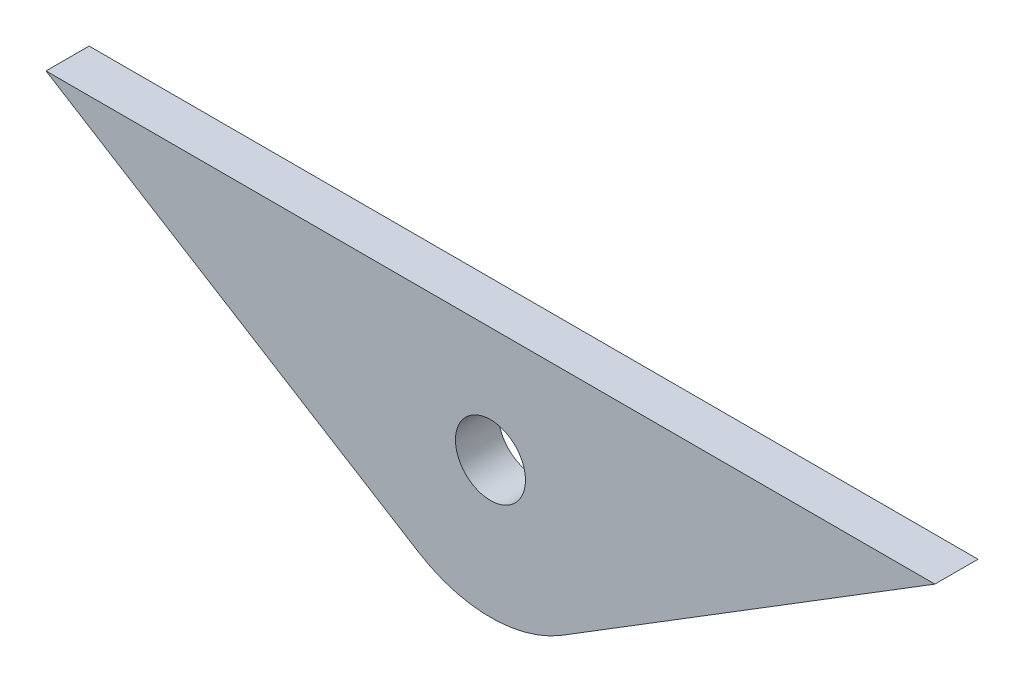
ISO-10303-21;
HEADER;
FILE_DESCRIPTION(('STEP AP214'),'2;1');
FILE_NAME('part.step','',(''),(''),'','','');
FILE_SCHEMA(('AUTOMOTIVE_DESIGN { 1 0 10303 214 1 1 1 1 }'));
ENDSEC;
DATA;
#1=APPLICATION_CONTEXT('core data for automotive mechanical design processes');
#2=APPLICATION_PROTOCOL_DEFINITION('international standard','automotive_design',2000,#1);
#3=PRODUCT_CONTEXT('',#1,'mechanical');
#4=PRODUCT('Part','Part','',(#3));
#5=PRODUCT_RELATED_PRODUCT_CATEGORY('part','',(#4));
#6=PRODUCT_DEFINITION_FORMATION('','',#4);
#7=PRODUCT_DEFINITION_CONTEXT('part definition',#1,'design');
#8=PRODUCT_DEFINITION('design','',#6,#7);
#9=PRODUCT_DEFINITION_SHAPE('','',#8);
#10=(LENGTH_UNIT() NAMED_UNIT(*) SI_UNIT(.MILLI.,.METRE.));
#11=(NAMED_UNIT(*) PLANE_ANGLE_UNIT() SI_UNIT($,.RADIAN.));
#12=(NAMED_UNIT(*) SI_UNIT($,.STERADIAN.) SOLID_ANGLE_UNIT());
#13=UNCERTAINTY_MEASURE_WITH_UNIT(LENGTH_MEASURE(1.E-05),#10,'distance_accuracy_value','');
#14=(GEOMETRIC_REPRESENTATION_CONTEXT(3) GLOBAL_UNCERTAINTY_ASSIGNED_CONTEXT((#13)) GLOBAL_UNIT_ASSIGNED_CONTEXT((#10,
#11,#12)) REPRESENTATION_CONTEXT('',''));
#15=CARTESIAN_POINT('',(0.,0.,0.));
#16=DIRECTION('',(0.,0.,1.));
#17=DIRECTION('',(1.,0.,0.));
#18=AXIS2_PLACEMENT_3D('',#15,#16,#17);
#19=CARTESIAN_POINT('',(-82.5016670475534,0.,-4.));
#20=DIRECTION('',(0.,0.999999999999999,0.));
#21=DIRECTION('',(0.,0.,0.999999999999999));
#22=AXIS2_PLACEMENT_3D('',#19,#20,#21);
#23=PLANE('',#22);
#24=DIRECTION('',(-0.999999999999999,0.,0.));
#25=VECTOR('',#24,1.);
#26=CARTESIAN_POINT('',(-82.5016670475534,0.,0.));
#27=LINE('',#26,#25);
#28=CARTESIAN_POINT('',(0.,0.,0.));
#29=VERTEX_POINT('',#28);
#30=CARTESIAN_POINT('',(-82.5016670475534,0.,0.));
#31=VERTEX_POINT('',#30);
#32=EDGE_CURVE('E99',#29,#31,#27,.T.);
#33=ORIENTED_EDGE('',*,*,#32,.F.);
#34=DIRECTION('',(0.,0.,0.999999999999999));
#35=VECTOR('',#34,1.);
#36=CARTESIAN_POINT('',(0.,0.,-4.));
#37=LINE('',#36,#35);
#38=CARTESIAN_POINT('',(0.,0.,-4.));
#39=VERTEX_POINT('',#38);
#40=EDGE_CURVE('E11',#39,#29,#37,.T.);
#41=ORIENTED_EDGE('',*,*,#40,.F.);
#42=DIRECTION('',(-0.999999999999999,0.,0.));
#43=VECTOR('',#42,1.);
#44=CARTESIAN_POINT('',(-82.5016670475534,0.,-4.));
#45=LINE('',#44,#43);
#46=CARTESIAN_POINT('',(-82.5016670475534,0.,-4.));
#47=VERTEX_POINT('',#46);
#48=EDGE_CURVE('E92',#39,#47,#45,.T.);
#49=ORIENTED_EDGE('',*,*,#48,.T.);
#50=DIRECTION('',(0.,0.,0.999999999999999));
#51=VECTOR('',#50,1.);
#52=CARTESIAN_POINT('',(-82.5016670475534,0.,-4.));
#53=LINE('',#52,#51);
#54=EDGE_CURVE('E37',#47,#31,#53,.T.);
#55=ORIENTED_EDGE('',*,*,#54,.T.);
#56=EDGE_LOOP('',(#33,#41,#49,#55));
#57=FACE_BOUND('',#56,.T.);
#58=ADVANCED_FACE('F34',(#57),#23,.T.);
#59=CARTESIAN_POINT('',(-34.5943627091045,-21.4070393832791,-4.00000000000017));
#60=DIRECTION('',(0.5262032264563,-0.850358844527989,0.));
#61=DIRECTION('',(0.85035884452799,0.526203226456302,0.));
#62=AXIS2_PLACEMENT_3D('',#59,#60,#61);
#63=PLANE('',#62);
#64=DIRECTION('',(0.85035884452799,0.526203226456302,0.));
#65=VECTOR('',#64,1.);
#66=CARTESIAN_POINT('',(-34.5943627091045,-21.4070393832791,-1.66533453693773E-13));
#67=LINE('',#66,#65);
#68=CARTESIAN_POINT('',(-34.5943627091045,-21.4070393832791,-1.66533453693773E-13));
#69=VERTEX_POINT('',#68);
#70=EDGE_CURVE('E94',#69,#29,#67,.T.);
#71=ORIENTED_EDGE('',*,*,#70,.F.);
#72=DIRECTION('',(0.,0.,0.999999999999999));
#73=VECTOR('',#72,1.);
#74=CARTESIAN_POINT('',(-34.5943627091045,-21.4070393832791,-4.00000000000017));
#75=LINE('',#74,#73);
#76=CARTESIAN_POINT('',(-34.5943627091045,-21.4070393832791,-4.00000000000017));
#77=VERTEX_POINT('',#76);
#78=EDGE_CURVE('E43',#77,#69,#75,.T.);
#79=ORIENTED_EDGE('',*,*,#78,.F.);
#80=DIRECTION('',(0.85035884452799,0.526203226456302,0.));
#81=VECTOR('',#80,1.);
#82=CARTESIAN_POINT('',(-34.5943627091045,-21.4070393832791,-4.00000000000017));
#83=LINE('',#82,#81);
#84=EDGE_CURVE('E89',#77,#39,#83,.T.);
#85=ORIENTED_EDGE('',*,*,#84,.T.);
#86=ORIENTED_EDGE('',*,*,#40,.T.);
#87=EDGE_LOOP('',(#71,#79,#85,#86));
#88=FACE_BOUND('',#87,.T.);
#89=ADVANCED_FACE('F110',(#88),#63,.T.);
#90=CARTESIAN_POINT('',(-41.2508335237767,-10.6500000000001,-4.00000000000017));
#91=DIRECTION('',(0.,0.,0.999999999999999));
#92=DIRECTION('',(0.999999999999999,0.,0.));
#93=AXIS2_PLACEMENT_3D('',#90,#91,#92);
#94=CYLINDRICAL_SURFACE('',#93,12.65);
#95=CARTESIAN_POINT('',(-41.2508335237767,-10.65,-1.66533453693773E-13));
#96=DIRECTION('',(0.,0.,0.999999999999999));
#97=DIRECTION('',(0.999999999999999,0.,0.));
#98=AXIS2_PLACEMENT_3D('',#95,#96,#97);
#99=CIRCLE('',#98,12.65);
#100=CARTESIAN_POINT('',(-47.9073043384489,-21.4070393832791,0.));
#101=VERTEX_POINT('',#100);
#102=EDGE_CURVE('E84',#101,#69,#99,.T.);
#103=ORIENTED_EDGE('',*,*,#102,.F.);
#104=DIRECTION('',(0.,0.,0.999999999999999));
#105=VECTOR('',#104,1.);
#106=CARTESIAN_POINT('',(-47.9073043384489,-21.4070393832791,-4.));
#107=LINE('',#106,#105);
#108=CARTESIAN_POINT('',(-47.9073043384489,-21.4070393832791,-4.));
#109=VERTEX_POINT('',#108);
#110=EDGE_CURVE('E79',#109,#101,#107,.T.);
#111=ORIENTED_EDGE('',*,*,#110,.F.);
#112=CARTESIAN_POINT('',(-41.2508335237767,-10.6500000000001,-4.00000000000017));
#113=DIRECTION('',(0.,0.,0.999999999999999));
#114=DIRECTION('',(0.999999999999999,0.,0.));
#115=AXIS2_PLACEMENT_3D('',#112,#113,#114);
#116=CIRCLE('',#115,12.65);
#117=EDGE_CURVE('E82',#109,#77,#116,.T.);
#118=ORIENTED_EDGE('',*,*,#117,.T.);
#119=ORIENTED_EDGE('',*,*,#78,.T.);
#120=EDGE_LOOP('',(#103,#111,#118,#119));
#121=FACE_BOUND('',#120,.T.);
#122=ADVANCED_FACE('F81',(#121),#94,.T.);
#123=CARTESIAN_POINT('',(-82.5016670475534,0.,-4.));
#124=DIRECTION('',(-0.526203226456302,-0.85035884452799,0.));
#125=DIRECTION('',(0.850358844527989,-0.5262032264563,0.));
#126=AXIS2_PLACEMENT_3D('',#123,#124,#125);
#127=PLANE('',#126);
#128=DIRECTION('',(0.850358844527989,-0.5262032264563,0.));
#129=VECTOR('',#128,1.);
#130=CARTESIAN_POINT('',(-82.5016670475534,0.,0.));
#131=LINE('',#130,#129);
#132=EDGE_CURVE('E102',#31,#101,#131,.T.);
#133=ORIENTED_EDGE('',*,*,#132,.F.);
#134=ORIENTED_EDGE('',*,*,#54,.F.);
#135=DIRECTION('',(0.850358844527989,-0.5262032264563,0.));
#136=VECTOR('',#135,1.);
#137=CARTESIAN_POINT('',(-82.5016670475534,0.,-4.));
#138=LINE('',#137,#136);
#139=EDGE_CURVE('E88',#47,#109,#138,.T.);
#140=ORIENTED_EDGE('',*,*,#139,.T.);
#141=ORIENTED_EDGE('',*,*,#110,.T.);
#142=EDGE_LOOP('',(#133,#134,#140,#141));
#143=FACE_BOUND('',#142,.T.);
#144=ADVANCED_FACE('F91',(#143),#127,.T.);
#145=CARTESIAN_POINT('',(-41.2508335237767,-10.6500000000001,-4.00000000000017));
#146=DIRECTION('',(0.,0.,0.999999999999999));
#147=DIRECTION('',(0.999999999999999,0.,0.));
#148=AXIS2_PLACEMENT_3D('',#145,#146,#147);
#149=PLANE('',#148);
#150=CARTESIAN_POINT('',(-41.2508335237767,-10.6500000000001,-4.00000000000017));
#151=DIRECTION('',(0.,0.,0.999999999999999));
#152=DIRECTION('',(0.999999999999999,0.,0.));
#153=AXIS2_PLACEMENT_3D('',#150,#151,#152);
#154=CIRCLE('',#153,3.25);
#155=CARTESIAN_POINT('',(-38.0008335237767,-10.6500000000001,-4.00000000000017));
#156=VERTEX_POINT('',#155);
#157=EDGE_CURVE('E103',#156,#156,#154,.T.);
#158=ORIENTED_EDGE('',*,*,#157,.T.);
#159=EDGE_LOOP('',(#158));
#160=FACE_BOUND('',#159,.T.);
#161=ORIENTED_EDGE('',*,*,#48,.F.);
#162=ORIENTED_EDGE('',*,*,#84,.F.);
#163=ORIENTED_EDGE('',*,*,#117,.F.);
#164=ORIENTED_EDGE('',*,*,#139,.F.);
#165=EDGE_LOOP('',(#161,#162,#163,#164));
#166=FACE_BOUND('',#165,.T.);
#167=ADVANCED_FACE('F87',(#160,#166),#149,.F.);
#168=CARTESIAN_POINT('',(-41.2508335237767,-10.65,-1.66533453693773E-13));
#169=DIRECTION('',(0.,0.,0.999999999999999));
#170=DIRECTION('',(0.999999999999999,0.,0.));
#171=AXIS2_PLACEMENT_3D('',#168,#169,#170);
#172=PLANE('',#171);
#173=CARTESIAN_POINT('',(-41.2508335237767,-10.65,-1.66533453693773E-13));
#174=DIRECTION('',(0.,0.,0.999999999999999));
#175=DIRECTION('',(0.999999999999999,0.,0.));
#176=AXIS2_PLACEMENT_3D('',#173,#174,#175);
#177=CIRCLE('',#176,3.25);
#178=CARTESIAN_POINT('',(-38.0008335237767,-10.65,-1.66533453693773E-13));
#179=VERTEX_POINT('',#178);
#180=EDGE_CURVE('E140',#179,#179,#177,.T.);
#181=ORIENTED_EDGE('',*,*,#180,.F.);
#182=EDGE_LOOP('',(#181));
#183=FACE_BOUND('',#182,.T.);
#184=ORIENTED_EDGE('',*,*,#32,.T.);
#185=ORIENTED_EDGE('',*,*,#132,.T.);
#186=ORIENTED_EDGE('',*,*,#102,.T.);
#187=ORIENTED_EDGE('',*,*,#70,.T.);
#188=EDGE_LOOP('',(#184,#185,#186,#187));
#189=FACE_BOUND('',#188,.T.);
#190=ADVANCED_FACE('F109',(#183,#189),#172,.T.);
#191=CARTESIAN_POINT('',(-41.2508335237767,-10.6500000000001,-4.00000000000017));
#192=DIRECTION('',(0.,0.,0.999999999999999));
#193=DIRECTION('',(0.999999999999999,0.,0.));
#194=AXIS2_PLACEMENT_3D('',#191,#192,#193);
#195=CYLINDRICAL_SURFACE('',#194,3.25);
#196=ORIENTED_EDGE('',*,*,#157,.F.);
#197=EDGE_LOOP('',(#196));
#198=FACE_BOUND('',#197,.T.);
#199=ORIENTED_EDGE('',*,*,#180,.T.);
#200=EDGE_LOOP('',(#199));
#201=FACE_BOUND('',#200,.T.);
#202=ADVANCED_FACE('F128',(#198,#201),#195,.F.);
#203=CLOSED_SHELL('',(#58,#89,#122,#144,#167,#190,#202));
#204=MANIFOLD_SOLID_BREP('B2',#203);
#205=ADVANCED_BREP_SHAPE_REPRESENTATION('',(#18,#204),#14);
#206=SHAPE_DEFINITION_REPRESENTATION(#9,#205);
ENDSEC;
END-ISO-10303-21;
